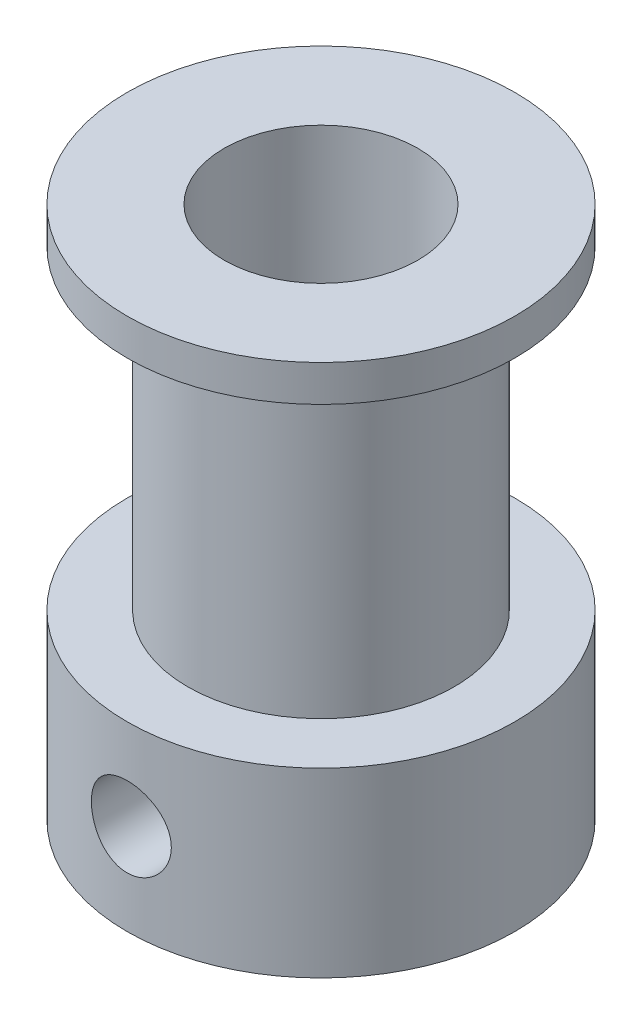
ISO-10303-21;
HEADER;
FILE_DESCRIPTION(('STEP AP214'),'2;1');
FILE_NAME('part.step','',(''),(''),'','','');
FILE_SCHEMA(('AUTOMOTIVE_DESIGN { 1 0 10303 214 1 1 1 1 }'));
ENDSEC;
DATA;
#1=APPLICATION_CONTEXT('core data for automotive mechanical design processes');
#2=APPLICATION_PROTOCOL_DEFINITION('international standard','automotive_design',2000,#1);
#3=PRODUCT_CONTEXT('',#1,'mechanical');
#4=PRODUCT('Part','Part','',(#3));
#5=PRODUCT_RELATED_PRODUCT_CATEGORY('part','',(#4));
#6=PRODUCT_DEFINITION_FORMATION('','',#4);
#7=PRODUCT_DEFINITION_CONTEXT('part definition',#1,'design');
#8=PRODUCT_DEFINITION('design','',#6,#7);
#9=PRODUCT_DEFINITION_SHAPE('','',#8);
#10=(LENGTH_UNIT() NAMED_UNIT(*) SI_UNIT(.MILLI.,.METRE.));
#11=(NAMED_UNIT(*) PLANE_ANGLE_UNIT() SI_UNIT($,.RADIAN.));
#12=(NAMED_UNIT(*) SI_UNIT($,.STERADIAN.) SOLID_ANGLE_UNIT());
#13=UNCERTAINTY_MEASURE_WITH_UNIT(LENGTH_MEASURE(1.E-05),#10,'distance_accuracy_value','');
#14=(GEOMETRIC_REPRESENTATION_CONTEXT(3) GLOBAL_UNCERTAINTY_ASSIGNED_CONTEXT((#13)) GLOBAL_UNIT_ASSIGNED_CONTEXT((#10,
#11,#12)) REPRESENTATION_CONTEXT('',''));
#15=CARTESIAN_POINT('',(0.,0.,0.));
#16=DIRECTION('',(0.,0.,1.));
#17=DIRECTION('',(1.,0.,0.));
#18=AXIS2_PLACEMENT_3D('',#15,#16,#17);
#19=CARTESIAN_POINT('',(0.,7.5,0.));
#20=DIRECTION('',(0.,1.,0.));
#21=DIRECTION('',(0.,0.,1.));
#22=AXIS2_PLACEMENT_3D('',#19,#20,#21);
#23=PLANE('',#22);
#24=CARTESIAN_POINT('',(0.,7.5,0.));
#25=DIRECTION('',(0.,1.,0.));
#26=DIRECTION('',(0.,0.,1.));
#27=AXIS2_PLACEMENT_3D('',#24,#25,#26);
#28=CIRCLE('',#27,8.);
#29=CARTESIAN_POINT('',(0.,7.5,8.));
#30=VERTEX_POINT('',#29);
#31=EDGE_CURVE('E10',#30,#30,#28,.T.);
#32=ORIENTED_EDGE('',*,*,#31,.T.);
#33=EDGE_LOOP('',(#32));
#34=FACE_BOUND('',#33,.T.);
#35=CARTESIAN_POINT('',(0.,7.5,0.));
#36=DIRECTION('',(0.,1.,0.));
#37=DIRECTION('',(0.,0.,1.));
#38=AXIS2_PLACEMENT_3D('',#35,#36,#37);
#39=CIRCLE('',#38,5.5);
#40=CARTESIAN_POINT('',(0.,7.5,5.5));
#41=VERTEX_POINT('',#40);
#42=EDGE_CURVE('E47',#41,#41,#39,.T.);
#43=ORIENTED_EDGE('',*,*,#42,.F.);
#44=EDGE_LOOP('',(#43));
#45=FACE_BOUND('',#44,.T.);
#46=ADVANCED_FACE('F34',(#34,#45),#23,.T.);
#47=CARTESIAN_POINT('',(0.,7.5,0.));
#48=DIRECTION('',(0.,-1.,0.));
#49=DIRECTION('',(0.,0.,-1.));
#50=AXIS2_PLACEMENT_3D('',#47,#48,#49);
#51=CYLINDRICAL_SURFACE('',#50,8.);
#52=CARTESIAN_POINT('',(-7.82799463464302,3.75,-1.65000000000002));
#53=CARTESIAN_POINT('',(-7.82799647234761,3.84161734979413,-1.64999668532495));
#54=CARTESIAN_POINT('',(-7.82962054015776,3.93327581475285,-1.64234339972767));
#55=CARTESIAN_POINT('',(-7.83593102109728,4.11399536908582,-1.61196056082938));
#56=CARTESIAN_POINT('',(-7.84061980768031,4.20305438944651,-1.5892193225455));
#57=CARTESIAN_POINT('',(-7.85250661788931,4.37593449220463,-1.52939944297716));
#58=CARTESIAN_POINT('',(-7.85970206178507,4.45976085561278,-1.49233553761894));
#59=CARTESIAN_POINT('',(-7.87578836285869,4.62000460226487,-1.40496339378159));
#60=CARTESIAN_POINT('',(-7.88467914491255,4.69642231357555,-1.35465574212319));
#61=CARTESIAN_POINT('',(-7.90330366333984,4.84083130314562,-1.24141806188278));
#62=CARTESIAN_POINT('',(-7.91304715328143,4.90869500128048,-1.17832691131061));
#63=CARTESIAN_POINT('',(-7.93219354684102,5.03295461376032,-1.04166118718971));
#64=CARTESIAN_POINT('',(-7.9415964257225,5.08934969657567,-0.968085854144728));
#65=CARTESIAN_POINT('',(-7.95910768239297,5.18956942635827,-0.811692001393481));
#66=CARTESIAN_POINT('',(-7.9672032148807,5.23327235381807,-0.728793920101091));
#67=CARTESIAN_POINT('',(-7.98107786735649,5.30608110943423,-0.556636173632906));
#68=CARTESIAN_POINT('',(-7.9868572180665,5.33518839158008,-0.467377143134544));
#69=CARTESIAN_POINT('',(-7.99537941797959,5.37758111250497,-0.286356118265347));
#70=CARTESIAN_POINT('',(-7.99816360714569,5.39108215209675,-0.194646593521417));
#71=CARTESIAN_POINT('',(-8.00052470522147,5.40255227142173,-0.0102247919218536));
#72=CARTESIAN_POINT('',(-8.00010194196704,5.40052293877214,0.0824873814688407));
#73=CARTESIAN_POINT('',(-7.9961286601365,5.3811524880959,0.264799667160857));
#74=CARTESIAN_POINT('',(-7.99262559257093,5.36404365512093,0.354425644609033));
#75=CARTESIAN_POINT('',(-7.98293899531616,5.3153688535758,0.529506535845897));
#76=CARTESIAN_POINT('',(-7.97675535366161,5.28380228111471,0.614961275239523));
#77=CARTESIAN_POINT('',(-7.96232481023259,5.20689604030914,0.779930808135305));
#78=CARTESIAN_POINT('',(-7.95406448397429,5.161466330109,0.859402403191171));
#79=CARTESIAN_POINT('',(-7.93638961806162,5.05819018594217,1.00967984091352));
#80=CARTESIAN_POINT('',(-7.9269749376687,5.00034223730045,1.08048462481767));
#81=CARTESIAN_POINT('',(-7.9078239642189,4.87260050730487,1.21279807501822));
#82=CARTESIAN_POINT('',(-7.89808494418977,4.80250342398988,1.27411022634261));
#83=CARTESIAN_POINT('',(-7.87954771497238,4.65292295474092,1.38414252261931));
#84=CARTESIAN_POINT('',(-7.87074952591437,4.57343936804768,1.43286239817595));
#85=CARTESIAN_POINT('',(-7.85508413098618,4.40704845467704,1.51640121308691));
#86=CARTESIAN_POINT('',(-7.84822159457677,4.32012382444695,1.55118662114804));
#87=CARTESIAN_POINT('',(-7.83727167258975,4.14148889177413,1.60559987539901));
#88=CARTESIAN_POINT('',(-7.83318390018328,4.04977925832742,1.625229834457));
#89=CARTESIAN_POINT('',(-7.82832430034405,3.86596343547278,1.64847767759944));
#90=CARTESIAN_POINT('',(-7.82749355348184,3.77389475085064,1.65238010858403));
#91=CARTESIAN_POINT('',(-7.82908365669821,3.59042212630601,1.64482933127382));
#92=CARTESIAN_POINT('',(-7.83150430988349,3.49901814646834,1.63337705280602));
#93=CARTESIAN_POINT('',(-7.83926913983493,3.32043707429369,1.59568777426683));
#94=CARTESIAN_POINT('',(-7.84458293687797,3.23322613369048,1.56960432546506));
#95=CARTESIAN_POINT('',(-7.85750843647708,3.06441223673719,1.50355797289369));
#96=CARTESIAN_POINT('',(-7.86512033846231,2.98280976784409,1.46359386451762));
#97=CARTESIAN_POINT('',(-7.88191579950282,2.82628854815773,1.37028211396983));
#98=CARTESIAN_POINT('',(-7.89111960565472,2.75147762450433,1.31675731908656));
#99=CARTESIAN_POINT('',(-7.91000699478186,2.61179547619869,1.1980782934733));
#100=CARTESIAN_POINT('',(-7.91969063034348,2.54692534419905,1.13292278604277));
#101=CARTESIAN_POINT('',(-7.93863877717958,2.42787906230575,0.991551131023601));
#102=CARTESIAN_POINT('',(-7.94789380519354,2.37389583014193,0.91517105125856));
#103=CARTESIAN_POINT('',(-7.96477402593325,2.27952771722255,0.754260738130239));
#104=CARTESIAN_POINT('',(-7.97239928979603,2.23914224289872,0.669730860728551));
#105=CARTESIAN_POINT('',(-7.98512048804082,2.17339319408157,0.495414150876506));
#106=CARTESIAN_POINT('',(-7.99023131933467,2.14794096923201,0.405661891513242));
#107=CARTESIAN_POINT('',(-7.99741186635557,2.11250124752192,0.223039444294558));
#108=CARTESIAN_POINT('',(-7.99948197278732,2.10251176383492,0.130169658580894));
#109=CARTESIAN_POINT('',(-8.00033781964049,2.09836207224363,-0.054212649205602));
#110=CARTESIAN_POINT('',(-7.99918360281958,2.10391248751722,-0.145718502140326));
#111=CARTESIAN_POINT('',(-7.99384751004402,2.13004339509045,-0.326463478938194));
#112=CARTESIAN_POINT('',(-7.98966567723011,2.15062367322843,-0.415702635080924));
#113=CARTESIAN_POINT('',(-7.97874682116245,2.2060981411582,-0.589186560182822));
#114=CARTESIAN_POINT('',(-7.97201637401338,2.24095551098701,-0.673443542985833));
#115=CARTESIAN_POINT('',(-7.95672300876336,2.32395704210639,-0.834953513276977));
#116=CARTESIAN_POINT('',(-7.9481599348062,2.37210233357252,-0.912205904261803));
#117=CARTESIAN_POINT('',(-7.92995681960444,2.48127864528561,-1.05893847166516));
#118=CARTESIAN_POINT('',(-7.92030089151861,2.54251556975004,-1.12826349061001));
#119=CARTESIAN_POINT('',(-7.90109178015231,2.67571624164646,-1.25575285452555));
#120=CARTESIAN_POINT('',(-7.89153862187156,2.74768253854538,-1.31391453937946));
#121=CARTESIAN_POINT('',(-7.87349423401939,2.9013011038279,-1.41807001635076));
#122=CARTESIAN_POINT('',(-7.86501660134748,2.98305600230841,-1.46391490783106));
#123=CARTESIAN_POINT('',(-7.85025069483304,3.15326288616914,-1.54114313624578));
#124=CARTESIAN_POINT('',(-7.84396047891661,3.2417088455668,-1.57253930936732));
#125=CARTESIAN_POINT('',(-7.83550744278865,3.40026722430231,-1.6140462079898));
#126=CARTESIAN_POINT('',(-7.83270799535492,3.46948894840103,-1.6275042042483));
#127=CARTESIAN_POINT('',(-7.82895092043293,3.60913237654465,-1.64548220150441));
#128=CARTESIAN_POINT('',(-7.82799322160417,3.67955403400329,-1.65000254870381));
#129=CARTESIAN_POINT('',(-7.82799463464302,3.75,-1.65000000000002));
#130=B_SPLINE_CURVE_WITH_KNOTS('',3,(#52,#53,#54,#55,#56,#57,#58,#59,#60,#61,#62,#63,#64,#65,
#66,#67,#68,#69,#70,#71,#72,#73,#74,#75,#76,#77,#78,#79,#80,#81,#82,#83,#84,#85,#86,#87,#88,#89,
#90,#91,#92,#93,#94,#95,#96,#97,#98,#99,#100,#101,#102,#103,#104,#105,#106,#107,#108,#109,#110,
#111,#112,#113,#114,#115,#116,#117,#118,#119,#120,#121,#122,#123,#124,#125,#126,#127,#128,#129),
.UNSPECIFIED.,.T.,.F.,(4,2,2,2,2,2,2,2,2,2,2,2,2,2,2,2,2,2,2,2,2,2,2,2,2,2,2,2,2,2,2,2,2,2,2,2,
2,2,4),(0.,0.274594036981749,0.549400984088786,0.823925944657621,1.09843874327276,
1.3766547467594,1.65489091505464,1.93571338943598,2.21650788327397,2.49337499570617,
2.77021380533169,3.04286128513493,3.31552015429503,3.58998907522695,3.86449149267072,
4.14407920367273,4.4236728956019,4.70393540521657,4.9841588355065,5.25928898855093,
5.53440248143716,5.80668132243981,6.07898379854718,6.35504561674318,6.6311377568341,
6.91175972338565,7.19236943866019,7.47129602001294,7.75018675877315,8.02391884651822,
8.29764703391013,8.57067368982019,8.84372357458458,9.1214337806041,9.39921008040027,
9.68020708192079,9.96095396255218,10.1721016499172,10.38324115827),.UNSPECIFIED.);
#131=CARTESIAN_POINT('',(-7.82799463464302,3.75,-1.65000000000002));
#132=VERTEX_POINT('',#131);
#133=EDGE_CURVE('E91',#132,#132,#130,.T.);
#134=ORIENTED_EDGE('',*,*,#133,.T.);
#135=EDGE_LOOP('',(#134));
#136=FACE_BOUND('',#135,.T.);
#137=CARTESIAN_POINT('',(-1.64999999999999,3.75,7.82799463464303));
#138=CARTESIAN_POINT('',(-1.64999668532493,3.84161734979413,7.82799647234762));
#139=CARTESIAN_POINT('',(-1.64234339972764,3.93327581475285,7.82962054015776));
#140=CARTESIAN_POINT('',(-1.61196056082935,4.11399536908582,7.83593102109728));
#141=CARTESIAN_POINT('',(-1.58921932254547,4.20305438944651,7.84061980768031));
#142=CARTESIAN_POINT('',(-1.52939944297714,4.37593449220463,7.85250661788931));
#143=CARTESIAN_POINT('',(-1.49233553761891,4.45976085561278,7.85970206178508));
#144=CARTESIAN_POINT('',(-1.40496339378156,4.62000460226487,7.8757883628587));
#145=CARTESIAN_POINT('',(-1.35465574212316,4.69642231357555,7.88467914491256));
#146=CARTESIAN_POINT('',(-1.24141806188275,4.84083130314562,7.90330366333985));
#147=CARTESIAN_POINT('',(-1.17832691131059,4.90869500128048,7.91304715328143));
#148=CARTESIAN_POINT('',(-1.04166118718968,5.03295461376032,7.93219354684102));
#149=CARTESIAN_POINT('',(-0.9680858541447,5.08934969657567,7.9415964257225));
#150=CARTESIAN_POINT('',(-0.811692001393454,5.18956942635827,7.95910768239297));
#151=CARTESIAN_POINT('',(-0.728793920101063,5.23327235381807,7.9672032148807));
#152=CARTESIAN_POINT('',(-0.556636173632879,5.30608110943423,7.98107786735649));
#153=CARTESIAN_POINT('',(-0.467377143134516,5.33518839158008,7.9868572180665));
#154=CARTESIAN_POINT('',(-0.28635611826532,5.37758111250497,7.99537941797959));
#155=CARTESIAN_POINT('',(-0.194646593521389,5.39108215209675,7.99816360714569));
#156=CARTESIAN_POINT('',(-0.010224791921826,5.40255227142173,8.00052470522147));
#157=CARTESIAN_POINT('',(0.0824873814688682,5.40052293877214,8.00010194196704));
#158=CARTESIAN_POINT('',(0.264799667160884,5.3811524880959,7.9961286601365));
#159=CARTESIAN_POINT('',(0.354425644609061,5.36404365512093,7.99262559257093));
#160=CARTESIAN_POINT('',(0.529506535845924,5.3153688535758,7.98293899531616));
#161=CARTESIAN_POINT('',(0.61496127523955,5.28380228111471,7.97675535366161));
#162=CARTESIAN_POINT('',(0.779930808135332,5.20689604030914,7.96232481023259));
#163=CARTESIAN_POINT('',(0.859402403191199,5.161466330109,7.95406448397429));
#164=CARTESIAN_POINT('',(1.00967984091354,5.05819018594217,7.93638961806161));
#165=CARTESIAN_POINT('',(1.08048462481769,5.00034223730045,7.92697493766869));
#166=CARTESIAN_POINT('',(1.21279807501824,4.87260050730487,7.9078239642189));
#167=CARTESIAN_POINT('',(1.27411022634264,4.80250342398989,7.89808494418976));
#168=CARTESIAN_POINT('',(1.38414252261934,4.65292295474092,7.87954771497238));
#169=CARTESIAN_POINT('',(1.43286239817597,4.57343936804768,7.87074952591437));
#170=CARTESIAN_POINT('',(1.51640121308694,4.40704845467704,7.85508413098618));
#171=CARTESIAN_POINT('',(1.55118662114807,4.32012382444695,7.84822159457677));
#172=CARTESIAN_POINT('',(1.60559987539903,4.14148889177413,7.83727167258975));
#173=CARTESIAN_POINT('',(1.62522983445702,4.04977925832743,7.83318390018328));
#174=CARTESIAN_POINT('',(1.64847767759947,3.86596343547278,7.82832430034404));
#175=CARTESIAN_POINT('',(1.65238010858406,3.77389475085064,7.82749355348184));
#176=CARTESIAN_POINT('',(1.64482933127385,3.59042212630601,7.8290836566982));
#177=CARTESIAN_POINT('',(1.63337705280605,3.49901814646834,7.83150430988348));
#178=CARTESIAN_POINT('',(1.59568777426686,3.32043707429369,7.83926913983493));
#179=CARTESIAN_POINT('',(1.56960432546508,3.23322613369048,7.84458293687796));
#180=CARTESIAN_POINT('',(1.50355797289372,3.06441223673719,7.85750843647708));
#181=CARTESIAN_POINT('',(1.46359386451765,2.98280976784409,7.8651203384623));
#182=CARTESIAN_POINT('',(1.37028211396986,2.82628854815773,7.88191579950281));
#183=CARTESIAN_POINT('',(1.31675731908659,2.75147762450433,7.89111960565472));
#184=CARTESIAN_POINT('',(1.19807829347332,2.61179547619869,7.91000699478186));
#185=CARTESIAN_POINT('',(1.1329227860428,2.54692534419906,7.91969063034348));
#186=CARTESIAN_POINT('',(0.99155113102363,2.42787906230575,7.93863877717957));
#187=CARTESIAN_POINT('',(0.915171051258588,2.37389583014193,7.94789380519354));
#188=CARTESIAN_POINT('',(0.754260738130267,2.27952771722255,7.96477402593325));
#189=CARTESIAN_POINT('',(0.66973086072858,2.23914224289872,7.97239928979603));
#190=CARTESIAN_POINT('',(0.495414150876535,2.17339319408157,7.98512048804082));
#191=CARTESIAN_POINT('',(0.405661891513271,2.14794096923201,7.99023131933467));
#192=CARTESIAN_POINT('',(0.223039444294587,2.11250124752192,7.99741186635557));
#193=CARTESIAN_POINT('',(0.130169658580922,2.10251176383492,7.99948197278732));
#194=CARTESIAN_POINT('',(-0.0542126492055734,2.09836207224363,8.00033781964049));
#195=CARTESIAN_POINT('',(-0.145718502140298,2.10391248751722,7.99918360281958));
#196=CARTESIAN_POINT('',(-0.326463478938166,2.13004339509045,7.99384751004402));
#197=CARTESIAN_POINT('',(-0.415702635080896,2.15062367322843,7.98966567723011));
#198=CARTESIAN_POINT('',(-0.589186560182793,2.2060981411582,7.97874682116246));
#199=CARTESIAN_POINT('',(-0.673443542985804,2.240955510987,7.97201637401338));
#200=CARTESIAN_POINT('',(-0.834953513276948,2.32395704210639,7.95672300876336));
#201=CARTESIAN_POINT('',(-0.912205904261775,2.37210233357252,7.9481599348062));
#202=CARTESIAN_POINT('',(-1.05893847166513,2.48127864528561,7.92995681960444));
#203=CARTESIAN_POINT('',(-1.12826349060999,2.54251556975004,7.92030089151861));
#204=CARTESIAN_POINT('',(-1.25575285452552,2.67571624164646,7.90109178015231));
#205=CARTESIAN_POINT('',(-1.31391453937944,2.74768253854538,7.89153862187157));
#206=CARTESIAN_POINT('',(-1.41807001635073,2.90130110382791,7.8734942340194));
#207=CARTESIAN_POINT('',(-1.46391490783103,2.98305600230841,7.86501660134749));
#208=CARTESIAN_POINT('',(-1.54114313624576,3.15326288616914,7.85025069483304));
#209=CARTESIAN_POINT('',(-1.57253930936729,3.2417088455668,7.84396047891661));
#210=CARTESIAN_POINT('',(-1.61404620798977,3.40026722430231,7.83550744278865));
#211=CARTESIAN_POINT('',(-1.62750420424827,3.46948894840103,7.83270799535493));
#212=CARTESIAN_POINT('',(-1.64548220150438,3.60913237654465,7.82895092043294));
#213=CARTESIAN_POINT('',(-1.65000254870379,3.67955403400329,7.82799322160417));
#214=CARTESIAN_POINT('',(-1.64999999999999,3.75,7.82799463464303));
#215=B_SPLINE_CURVE_WITH_KNOTS('',3,(#137,#138,#139,#140,#141,#142,#143,#144,#145,#146,#147,
#148,#149,#150,#151,#152,#153,#154,#155,#156,#157,#158,#159,#160,#161,#162,#163,#164,#165,#166,
#167,#168,#169,#170,#171,#172,#173,#174,#175,#176,#177,#178,#179,#180,#181,#182,#183,#184,#185,
#186,#187,#188,#189,#190,#191,#192,#193,#194,#195,#196,#197,#198,#199,#200,#201,#202,#203,#204,
#205,#206,#207,#208,#209,#210,#211,#212,#213,#214),.UNSPECIFIED.,.T.,.F.,(4,2,2,2,2,2,2,2,2,2,2,
2,2,2,2,2,2,2,2,2,2,2,2,2,2,2,2,2,2,2,2,2,2,2,2,2,2,2,4),(0.,0.274594036981749,
0.549400984088785,0.82392594465762,1.09843874327276,1.3766547467594,1.65489091505464,
1.93571338943597,2.21650788327397,2.49337499570617,2.77021380533169,3.04286128513493,
3.31552015429503,3.58998907522695,3.86449149267071,4.14407920367273,4.42367289560189,
4.70393540521657,4.9841588355065,5.25928898855093,5.53440248143716,5.8066813224398,
6.07898379854718,6.35504561674318,6.6311377568341,6.91175972338564,7.19236943866019,
7.47129602001293,7.75018675877315,8.02391884651822,8.29764703391013,8.57067368982019,
8.84372357458458,9.1214337806041,9.39921008040027,9.68020708192079,9.96095396255218,
10.1721016499172,10.38324115827),.UNSPECIFIED.);
#216=CARTESIAN_POINT('',(-1.64999999999999,3.75,7.82799463464303));
#217=VERTEX_POINT('',#216);
#218=EDGE_CURVE('E71',#217,#217,#215,.T.);
#219=ORIENTED_EDGE('',*,*,#218,.T.);
#220=EDGE_LOOP('',(#219));
#221=FACE_BOUND('',#220,.T.);
#222=ORIENTED_EDGE('',*,*,#31,.F.);
#223=EDGE_LOOP('',(#222));
#224=FACE_BOUND('',#223,.T.);
#225=CARTESIAN_POINT('',(0.,0.,0.));
#226=DIRECTION('',(0.,1.,0.));
#227=DIRECTION('',(0.,0.,1.));
#228=AXIS2_PLACEMENT_3D('',#225,#226,#227);
#229=CIRCLE('',#228,8.);
#230=CARTESIAN_POINT('',(0.,0.,8.));
#231=VERTEX_POINT('',#230);
#232=EDGE_CURVE('E38',#231,#231,#229,.T.);
#233=ORIENTED_EDGE('',*,*,#232,.T.);
#234=EDGE_LOOP('',(#233));
#235=FACE_BOUND('',#234,.T.);
#236=ADVANCED_FACE('F36',(#136,#221,#224,#235),#51,.T.);
#237=CARTESIAN_POINT('',(0.,0.,0.));
#238=DIRECTION('',(0.,1.,0.));
#239=DIRECTION('',(0.,0.,1.));
#240=AXIS2_PLACEMENT_3D('',#237,#238,#239);
#241=PLANE('',#240);
#242=CARTESIAN_POINT('',(0.,0.,0.));
#243=DIRECTION('',(0.,1.,0.));
#244=DIRECTION('',(0.,0.,1.));
#245=AXIS2_PLACEMENT_3D('',#242,#243,#244);
#246=CIRCLE('',#245,4.);
#247=CARTESIAN_POINT('',(0.,0.,4.));
#248=VERTEX_POINT('',#247);
#249=EDGE_CURVE('E56',#248,#248,#246,.T.);
#250=ORIENTED_EDGE('',*,*,#249,.T.);
#251=EDGE_LOOP('',(#250));
#252=FACE_BOUND('',#251,.T.);
#253=ORIENTED_EDGE('',*,*,#232,.F.);
#254=EDGE_LOOP('',(#253));
#255=FACE_BOUND('',#254,.T.);
#256=ADVANCED_FACE('F134',(#252,#255),#241,.F.);
#257=CARTESIAN_POINT('',(0.,20.5,0.));
#258=DIRECTION('',(0.,-1.,0.));
#259=DIRECTION('',(0.,0.,-1.));
#260=AXIS2_PLACEMENT_3D('',#257,#258,#259);
#261=CYLINDRICAL_SURFACE('',#260,5.5);
#262=CARTESIAN_POINT('',(0.,20.5,0.));
#263=DIRECTION('',(0.,1.,0.));
#264=DIRECTION('',(0.,0.,1.));
#265=AXIS2_PLACEMENT_3D('',#262,#263,#264);
#266=CIRCLE('',#265,5.5);
#267=CARTESIAN_POINT('',(0.,20.5,5.5));
#268=VERTEX_POINT('',#267);
#269=EDGE_CURVE('E45',#268,#268,#266,.T.);
#270=ORIENTED_EDGE('',*,*,#269,.F.);
#271=EDGE_LOOP('',(#270));
#272=FACE_BOUND('',#271,.T.);
#273=ORIENTED_EDGE('',*,*,#42,.T.);
#274=EDGE_LOOP('',(#273));
#275=FACE_BOUND('',#274,.T.);
#276=ADVANCED_FACE('F128',(#272,#275),#261,.T.);
#277=CARTESIAN_POINT('',(0.,20.5,0.));
#278=DIRECTION('',(0.,1.,0.));
#279=DIRECTION('',(0.,0.,1.));
#280=AXIS2_PLACEMENT_3D('',#277,#278,#279);
#281=PLANE('',#280);
#282=CARTESIAN_POINT('',(0.,20.5,0.));
#283=DIRECTION('',(0.,1.,0.));
#284=DIRECTION('',(0.,0.,1.));
#285=AXIS2_PLACEMENT_3D('',#282,#283,#284);
#286=CIRCLE('',#285,8.);
#287=CARTESIAN_POINT('',(0.,20.5,8.));
#288=VERTEX_POINT('',#287);
#289=EDGE_CURVE('E53',#288,#288,#286,.T.);
#290=ORIENTED_EDGE('',*,*,#289,.F.);
#291=EDGE_LOOP('',(#290));
#292=FACE_BOUND('',#291,.T.);
#293=ORIENTED_EDGE('',*,*,#269,.T.);
#294=EDGE_LOOP('',(#293));
#295=FACE_BOUND('',#294,.T.);
#296=ADVANCED_FACE('F122',(#292,#295),#281,.F.);
#297=CARTESIAN_POINT('',(0.,22.,0.));
#298=DIRECTION('',(0.,-1.,0.));
#299=DIRECTION('',(0.,0.,-1.));
#300=AXIS2_PLACEMENT_3D('',#297,#298,#299);
#301=CYLINDRICAL_SURFACE('',#300,8.);
#302=CARTESIAN_POINT('',(0.,22.,0.));
#303=DIRECTION('',(0.,1.,0.));
#304=DIRECTION('',(0.,0.,1.));
#305=AXIS2_PLACEMENT_3D('',#302,#303,#304);
#306=CIRCLE('',#305,8.);
#307=CARTESIAN_POINT('',(0.,22.,8.));
#308=VERTEX_POINT('',#307);
#309=EDGE_CURVE('E50',#308,#308,#306,.T.);
#310=ORIENTED_EDGE('',*,*,#309,.F.);
#311=EDGE_LOOP('',(#310));
#312=FACE_BOUND('',#311,.T.);
#313=ORIENTED_EDGE('',*,*,#289,.T.);
#314=EDGE_LOOP('',(#313));
#315=FACE_BOUND('',#314,.T.);
#316=ADVANCED_FACE('F117',(#312,#315),#301,.T.);
#317=CARTESIAN_POINT('',(0.,22.,0.));
#318=DIRECTION('',(0.,1.,0.));
#319=DIRECTION('',(0.,0.,1.));
#320=AXIS2_PLACEMENT_3D('',#317,#318,#319);
#321=PLANE('',#320);
#322=CARTESIAN_POINT('',(0.,22.,0.));
#323=DIRECTION('',(0.,1.,0.));
#324=DIRECTION('',(0.,0.,1.));
#325=AXIS2_PLACEMENT_3D('',#322,#323,#324);
#326=CIRCLE('',#325,4.);
#327=CARTESIAN_POINT('',(0.,22.,4.));
#328=VERTEX_POINT('',#327);
#329=EDGE_CURVE('E59',#328,#328,#326,.T.);
#330=ORIENTED_EDGE('',*,*,#329,.F.);
#331=EDGE_LOOP('',(#330));
#332=FACE_BOUND('',#331,.T.);
#333=ORIENTED_EDGE('',*,*,#309,.T.);
#334=EDGE_LOOP('',(#333));
#335=FACE_BOUND('',#334,.T.);
#336=ADVANCED_FACE('F110',(#332,#335),#321,.T.);
#337=CARTESIAN_POINT('',(0.,0.,0.));
#338=DIRECTION('',(0.,1.,0.));
#339=DIRECTION('',(0.,0.,1.));
#340=AXIS2_PLACEMENT_3D('',#337,#338,#339);
#341=CYLINDRICAL_SURFACE('',#340,4.);
#342=CARTESIAN_POINT('',(-3.64383040220041,3.75,-1.65000000000001));
#343=CARTESIAN_POINT('',(-3.64383945275152,3.66190351977432,-1.64999056813103));
#344=CARTESIAN_POINT('',(-3.64707173267573,3.57365956802641,-1.64289989177359));
#345=CARTESIAN_POINT('',(-3.65959209124688,3.39971293892112,-1.61480845546374));
#346=CARTESIAN_POINT('',(-3.66889676295874,3.3140178994024,-1.5937695789634));
#347=CARTESIAN_POINT('',(-3.69231325052125,3.14799706186937,-1.53873536249639));
#348=CARTESIAN_POINT('',(-3.70640571161012,3.06765117978141,-1.50479212400174));
#349=CARTESIAN_POINT('',(-3.73778230052357,2.91381823316578,-1.42506535594207));
#350=CARTESIAN_POINT('',(-3.75506562873472,2.84032945721597,-1.37928479159596));
#351=CARTESIAN_POINT('',(-3.7920553041855,2.6977713121535,-1.27419856290372));
#352=CARTESIAN_POINT('',(-3.81184277704779,2.6291707442198,-1.21428518241361));
#353=CARTESIAN_POINT('',(-3.85094363418238,2.50264522809125,-1.08391072165484));
#354=CARTESIAN_POINT('',(-3.87025683535296,2.44472434852778,-1.01344563996365));
#355=CARTESIAN_POINT('',(-3.90721575035942,2.33882862869814,-0.860301943593392));
#356=CARTESIAN_POINT('',(-3.92475616703247,2.29137906729385,-0.777232390113601));
#357=CARTESIAN_POINT('',(-3.95520283117798,2.2113298546783,-0.603436361875868));
#358=CARTESIAN_POINT('',(-3.96811109652272,2.17872373565345,-0.512713242513056));
#359=CARTESIAN_POINT('',(-3.98726403378776,2.13097929334378,-0.33110517230441));
#360=CARTESIAN_POINT('',(-3.99381564337609,2.11503315207677,-0.240465625184504));
#361=CARTESIAN_POINT('',(-4.0006306156112,2.09845334814483,-0.0575763551498781));
#362=CARTESIAN_POINT('',(-4.00089647540932,2.097813604678,0.0346727137709419));
#363=CARTESIAN_POINT('',(-3.99529224160632,2.1114364961366,0.212297380895971));
#364=CARTESIAN_POINT('',(-3.98978733384659,2.1248121837171,0.297754665400383));
#365=CARTESIAN_POINT('',(-3.97375926025945,2.16456881744776,0.465085845235265));
#366=CARTESIAN_POINT('',(-3.96323572489497,2.19095072129069,0.546959476205478));
#367=CARTESIAN_POINT('',(-3.93798907731603,2.25628766172019,0.706295606817214));
#368=CARTESIAN_POINT('',(-3.92320447216363,2.29542798992488,0.783671979762454));
#369=CARTESIAN_POINT('',(-3.89088763760773,2.38499127918661,0.930960489992451));
#370=CARTESIAN_POINT('',(-3.87335444442337,2.43541820050331,1.0008699945393));
#371=CARTESIAN_POINT('',(-3.83587133640028,2.55018823902864,1.13638530947039));
#372=CARTESIAN_POINT('',(-3.8158381454309,2.61525341089873,1.20135746318643));
#373=CARTESIAN_POINT('',(-3.77653142784556,2.75540966632158,1.31973838423492));
#374=CARTESIAN_POINT('',(-3.75725818494774,2.83050444926331,1.373142865722));
#375=CARTESIAN_POINT('',(-3.7210660715691,2.99159840354732,1.46845339844826));
#376=CARTESIAN_POINT('',(-3.70424107982559,3.07786757169265,1.50994179309275));
#377=CARTESIAN_POINT('',(-3.67596385006486,3.2570466714059,1.57754508127094));
#378=CARTESIAN_POINT('',(-3.66450786071418,3.34995191387382,1.60367071206119));
#379=CARTESIAN_POINT('',(-3.64919091711419,3.53342289518499,1.6382132035594));
#380=CARTESIAN_POINT('',(-3.64489111171832,3.62375830118286,1.6476556945468));
#381=CARTESIAN_POINT('',(-3.64311980380968,3.8048056296986,1.65157101672825));
#382=CARTESIAN_POINT('',(-3.6456460160745,3.89551741605928,1.646048857804));
#383=CARTESIAN_POINT('',(-3.65678944366162,4.06880100904947,1.62112710501825));
#384=CARTESIAN_POINT('',(-3.66501803861665,4.15152817967461,1.60261202118541));
#385=CARTESIAN_POINT('',(-3.68614612916708,4.31263706437997,1.55339580262013));
#386=CARTESIAN_POINT('',(-3.69904670212357,4.39101777135166,1.52269185697121));
#387=CARTESIAN_POINT('',(-3.72872477858183,4.54487900569563,1.44853902204983));
#388=CARTESIAN_POINT('',(-3.74564214050946,4.62010019477924,1.40460979308262));
#389=CARTESIAN_POINT('',(-3.78124523189865,4.76246016942973,1.30573455409449));
#390=CARTESIAN_POINT('',(-3.79993171387675,4.82959548773512,1.25078384473682));
#391=CARTESIAN_POINT('',(-3.83876011670653,4.95942962644671,1.12627542162097));
#392=CARTESIAN_POINT('',(-3.85889967217623,5.02135173704872,1.05590387126702));
#393=CARTESIAN_POINT('',(-3.89698114804695,5.13264285566206,0.905297980080087));
#394=CARTESIAN_POINT('',(-3.91492292631237,5.18201105200319,0.825063002026887));
#395=CARTESIAN_POINT('',(-3.94668767391886,5.26670413420678,0.656516816883251));
#396=CARTESIAN_POINT('',(-3.96050313975064,5.30200347500272,0.568191273870476));
#397=CARTESIAN_POINT('',(-3.98237104121022,5.35699165685874,0.386140833605162));
#398=CARTESIAN_POINT('',(-3.9904268305481,5.37668958293893,0.292419112817546));
#399=CARTESIAN_POINT('',(-3.9994889299446,5.39878822892048,0.109187189544822));
#400=CARTESIAN_POINT('',(-4.00094173424749,5.40228482874193,0.0198303081186213));
#401=CARTESIAN_POINT('',(-3.99786220239438,5.39481456562971,-0.158161739195425));
#402=CARTESIAN_POINT('',(-3.99333087896147,5.38385015000454,-0.246797024648493));
#403=CARTESIAN_POINT('',(-3.979024148364,5.34855535786443,-0.417705375935888));
#404=CARTESIAN_POINT('',(-3.96943363922013,5.32469555788544,-0.500092371627863));
#405=CARTESIAN_POINT('',(-3.94605480923815,5.26479588512,-0.65966735573417));
#406=CARTESIAN_POINT('',(-3.93226568297162,5.22875367521331,-0.736854343148754));
#407=CARTESIAN_POINT('',(-3.90105808483759,5.14369547331361,-0.887661133732629));
#408=CARTESIAN_POINT('',(-3.88350423911689,5.09416874322707,-0.96096421436116));
#409=CARTESIAN_POINT('',(-3.84685709666619,4.98429715321,-1.09852932170706));
#410=CARTESIAN_POINT('',(-3.82776324400832,4.92394837691919,-1.16278806031651));
#411=CARTESIAN_POINT('',(-3.78859741195737,4.78941247264534,-1.28487769945048));
#412=CARTESIAN_POINT('',(-3.76854475207571,4.71457224311506,-1.34199767947158));
#413=CARTESIAN_POINT('',(-3.73105419200533,4.55573402431893,-1.44296474677331));
#414=CARTESIAN_POINT('',(-3.71361773967119,4.47173100829041,-1.48680449811904));
#415=CARTESIAN_POINT('',(-3.68370387904713,4.2972715587301,-1.55944447766652));
#416=CARTESIAN_POINT('',(-3.67119480418033,4.2068608919089,-1.58834112875234));
#417=CARTESIAN_POINT('',(-3.65281837075146,4.02195285592164,-1.63017263567573));
#418=CARTESIAN_POINT('',(-3.64692873900432,3.92747030912313,-1.64316103312975));
#419=CARTESIAN_POINT('',(-3.64414054419779,3.80513668635736,-1.6493120932942));
#420=CARTESIAN_POINT('',(-3.64382756923722,3.77757556771498,-1.65000295232161));
#421=CARTESIAN_POINT('',(-3.64383040220041,3.75,-1.65000000000001));
#422=B_SPLINE_CURVE_WITH_KNOTS('',3,(#342,#343,#344,#345,#346,#347,#348,#349,#350,#351,#352,
#353,#354,#355,#356,#357,#358,#359,#360,#361,#362,#363,#364,#365,#366,#367,#368,#369,#370,#371,
#372,#373,#374,#375,#376,#377,#378,#379,#380,#381,#382,#383,#384,#385,#386,#387,#388,#389,#390,
#391,#392,#393,#394,#395,#396,#397,#398,#399,#400,#401,#402,#403,#404,#405,#406,#407,#408,#409,
#410,#411,#412,#413,#414,#415,#416,#417,#418,#419,#420,#421),.UNSPECIFIED.,.T.,.F.,(4,2,2,2,2,2,
2,2,2,2,2,2,2,2,2,2,2,2,2,2,2,2,2,2,2,2,2,2,2,2,2,2,2,2,2,2,2,2,2,4),(0.,0.264211724660743,
0.529148459018595,0.793026677872046,1.05683885985755,1.33523297260791,1.61373292676209,
1.90403076094907,2.19420198072698,2.46953816244269,2.74476495901023,3.00356896819765,
3.2623920368679,3.52515526924738,3.78801084539544,4.06907613148063,4.35024537535723,
4.64031806272421,4.93018777241108,5.20152035698261,5.4727621157604,5.72713321026164,
5.98156300028878,6.24665916965706,6.51186861189121,6.79815687284344,7.0844636389886,
7.37128791456167,7.65794504349147,7.92489841526076,8.19180661499932,8.44957452423756,
8.70739191275385,8.97680852354691,9.24632283025303,9.53374725602172,9.82133016535512,
10.1070334851925,10.3917725616093,10.4744749384331),.UNSPECIFIED.);
#423=CARTESIAN_POINT('',(-3.64383040220041,3.75,-1.65000000000001));
#424=VERTEX_POINT('',#423);
#425=EDGE_CURVE('E95',#424,#424,#422,.T.);
#426=ORIENTED_EDGE('',*,*,#425,.T.);
#427=EDGE_LOOP('',(#426));
#428=FACE_BOUND('',#427,.T.);
#429=CARTESIAN_POINT('',(0.,2.10000000000001,4.));
#430=CARTESIAN_POINT('',(0.0884596783632785,2.10000921720664,3.99999309817074));
#431=CARTESIAN_POINT('',(0.177062252057582,2.10715601434332,3.99703145792172));
#432=CARTESIAN_POINT('',(0.351759669836408,2.1354911419369,3.9854711320255));
#433=CARTESIAN_POINT('',(0.437847271996959,2.15671651102432,3.97685757767606));
#434=CARTESIAN_POINT('',(0.604702496902739,2.2122948122019,3.95491965529936));
#435=CARTESIAN_POINT('',(0.685486934491194,2.24660364335346,3.94161112398211));
#436=CARTESIAN_POINT('',(0.840076633223485,2.32719475784943,3.91158286286531));
#437=CARTESIAN_POINT('',(0.913884076117563,2.37347328117016,3.89486420463244));
#438=CARTESIAN_POINT('',(1.05618769598525,2.47910675464405,3.85876900012149));
#439=CARTESIAN_POINT('',(1.12429373957476,2.53895767024898,3.83930654387258));
#440=CARTESIAN_POINT('',(1.24983574384757,2.66898883965898,3.80029483347099));
#441=CARTESIAN_POINT('',(1.30726618926957,2.73917439921181,3.78074553976622));
#442=CARTESIAN_POINT('',(1.41254826809049,2.89196824887172,3.74272551686067));
#443=CARTESIAN_POINT('',(1.45980781790561,2.97501111530653,3.72435159658093));
#444=CARTESIAN_POINT('',(1.53951358199406,3.14873630929018,3.69212136090386));
#445=CARTESIAN_POINT('',(1.5719672771279,3.23941475136301,3.67826276509115));
#446=CARTESIAN_POINT('',(1.61953738222492,3.42134799700183,3.65756021871623));
#447=CARTESIAN_POINT('',(1.63540371417153,3.51237107214307,3.65041449103236));
#448=CARTESIAN_POINT('',(1.65168918120802,3.69604650736528,3.64307714795703));
#449=CARTESIAN_POINT('',(1.65211659474,3.7886979676293,3.64288180572738));
#450=CARTESIAN_POINT('',(1.6380778077983,3.96559888661872,3.64921138579605));
#451=CARTESIAN_POINT('',(1.62472398487458,4.04995815874916,3.6552343974104));
#452=CARTESIAN_POINT('',(1.58536484231197,4.21511028438117,3.67247532251837));
#453=CARTESIAN_POINT('',(1.55935715587184,4.2959024676033,3.68369420783859));
#454=CARTESIAN_POINT('',(1.49492412942488,4.45364510875862,3.71031458481431));
#455=CARTESIAN_POINT('',(1.45624866973016,4.53047873780833,3.72579923184191));
#456=CARTESIAN_POINT('',(1.36775445443624,4.67686023246003,3.75918616236907));
#457=CARTESIAN_POINT('',(1.31793135478159,4.74640524224915,3.77708938726885));
#458=CARTESIAN_POINT('',(1.20371911924869,4.88228640778781,3.81509742396095));
#459=CARTESIAN_POINT('',(1.13846630094388,4.94788195770325,3.8352618825369));
#460=CARTESIAN_POINT('',(0.997682554866211,5.06744467444137,3.87426910607353));
#461=CARTESIAN_POINT('',(0.92214931984743,5.12140922386084,3.8931115728953));
#462=CARTESIAN_POINT('',(0.760736369737321,5.21723477358503,3.92787932271737));
#463=CARTESIAN_POINT('',(0.674664094072233,5.25880028319417,3.94373050716791));
#464=CARTESIAN_POINT('',(0.495928253552974,5.32660302410887,3.97016319816605));
#465=CARTESIAN_POINT('',(0.403268287372383,5.35284855321116,3.98074755693754));
#466=CARTESIAN_POINT('',(0.220181304317672,5.38772950367822,3.99492450637935));
#467=CARTESIAN_POINT('',(0.12997417230822,5.39735917793593,3.99891121146315));
#468=CARTESIAN_POINT('',(-0.050847440152223,5.40169204376329,4.00069746426785));
#469=CARTESIAN_POINT('',(-0.141461799500567,5.39639941310821,3.99849874371343));
#470=CARTESIAN_POINT('',(-0.315907755487548,5.37175473175704,3.98841747083847));
#471=CARTESIAN_POINT('',(-0.399855317526685,5.3530959266599,3.9808153168881));
#472=CARTESIAN_POINT('',(-0.563340473329574,5.30320790366289,3.96098887803091));
#473=CARTESIAN_POINT('',(-0.642877505872145,5.2719770901852,3.94876400644332));
#474=CARTESIAN_POINT('',(-0.798061975964473,5.1968106200191,3.92039728883464));
#475=CARTESIAN_POINT('',(-0.873512656660505,5.15251143824378,3.90414585630856));
#476=CARTESIAN_POINT('',(-1.01617847320907,5.05286606574213,3.86946768187548));
#477=CARTESIAN_POINT('',(-1.0833901834211,4.99751530491016,3.85104004134398));
#478=CARTESIAN_POINT('',(-1.21261994292741,4.87279569518802,3.8124029584454));
#479=CARTESIAN_POINT('',(-1.27394364561822,4.8027161759607,3.79215916493832));
#480=CARTESIAN_POINT('',(-1.38414835482505,4.65292870939147,3.75333928940831));
#481=CARTESIAN_POINT('',(-1.43302674162727,4.57321874005744,3.73476355904109));
#482=CARTESIAN_POINT('',(-1.51742282291387,4.40490462946668,3.70128700339843));
#483=CARTESIAN_POINT('',(-1.55275802936534,4.31619808399194,3.68643724424496));
#484=CARTESIAN_POINT('',(-1.60769618165393,4.13329083402175,3.66281640168181));
#485=CARTESIAN_POINT('',(-1.62731175174752,4.03909460358182,3.65404044124936));
#486=CARTESIAN_POINT('',(-1.64901123940267,3.85556972684193,3.64429559365239));
#487=CARTESIAN_POINT('',(-1.65231049364124,3.76641278054206,3.64278573581524));
#488=CARTESIAN_POINT('',(-1.64451485356567,3.58887152924082,3.64631178238904));
#489=CARTESIAN_POINT('',(-1.63342206561729,3.50048711308063,3.65134672892697));
#490=CARTESIAN_POINT('',(-1.59817118006571,3.3310669287423,3.666904904187));
#491=CARTESIAN_POINT('',(-1.57461958437453,3.24987928857789,3.67717261200251));
#492=CARTESIAN_POINT('',(-1.51570599472927,3.09258547752592,3.70184411206584));
#493=CARTESIAN_POINT('',(-1.48034069596892,3.01648073570239,3.71624906152171));
#494=CARTESIAN_POINT('',(-1.3963806225379,2.86657796175861,3.7486340889516));
#495=CARTESIAN_POINT('',(-1.3471244359927,2.79318592897859,3.76677577854003));
#496=CARTESIAN_POINT('',(-1.23771718137822,2.65532831273572,3.80412864636709));
#497=CARTESIAN_POINT('',(-1.17756245772962,2.59086573722558,3.82334018195057));
#498=CARTESIAN_POINT('',(-1.04300738755743,2.46800586129633,3.86230172013188));
#499=CARTESIAN_POINT('',(-0.967900110730173,2.41036077639448,3.88199359359226));
#500=CARTESIAN_POINT('',(-0.808343463182031,2.30845984046129,3.91832426905579));
#501=CARTESIAN_POINT('',(-0.723889843442848,2.26421011363411,3.9349616732268));
#502=CARTESIAN_POINT('',(-0.549414760109625,2.19133626016526,3.96305691394126));
#503=CARTESIAN_POINT('',(-0.459513381649423,2.16245757464146,3.97459855421812));
#504=CARTESIAN_POINT('',(-0.27571922921324,2.12048891521486,3.99154438775475));
#505=CARTESIAN_POINT('',(-0.181839966818028,2.10734933375456,3.99696786149576));
#506=CARTESIAN_POINT('',(-0.0584442952271953,2.10077322966997,3.99968194626838));
#507=CARTESIAN_POINT('',(-0.0292299486703375,2.09999695433579,4.00000228058838));
#508=CARTESIAN_POINT('',(0.,2.10000000000001,4.));
#509=B_SPLINE_CURVE_WITH_KNOTS('',3,(#429,#430,#431,#432,#433,#434,#435,#436,#437,#438,#439,
#440,#441,#442,#443,#444,#445,#446,#447,#448,#449,#450,#451,#452,#453,#454,#455,#456,#457,#458,
#459,#460,#461,#462,#463,#464,#465,#466,#467,#468,#469,#470,#471,#472,#473,#474,#475,#476,#477,
#478,#479,#480,#481,#482,#483,#484,#485,#486,#487,#488,#489,#490,#491,#492,#493,#494,#495,#496,
#497,#498,#499,#500,#501,#502,#503,#504,#505,#506,#507,#508),.UNSPECIFIED.,.T.,.F.,(4,2,2,2,2,2,
2,2,2,2,2,2,2,2,2,2,2,2,2,2,2,2,2,2,2,2,2,2,2,2,2,2,2,2,2,2,2,2,2,4),(0.,0.265297098770619,
0.531294937906658,0.796403981498878,1.06142984766523,1.33841878994456,1.61555043582129,
1.90598404924537,2.19627075414924,2.4727764853942,2.74913395037959,3.00480633611682,
3.2605265616686,3.5216353930134,3.78284615202014,4.06565185095455,4.34852112528508,
4.63767392136374,4.92666995726766,5.19768149557684,5.46861716672804,5.72643264660553,
5.98428085748383,6.25011488704504,6.51605907418431,6.800645802504,7.08529238632157,
7.37364985225779,7.66177550895674,7.92807823226722,8.19434198489782,8.44869772098557,
8.70312467109942,8.97267479984707,9.2423155088521,9.53104085816539,9.81989801073176,
10.1038095613048,10.3868238858898,10.4744866574817),.UNSPECIFIED.);
#510=CARTESIAN_POINT('',(0.,2.10000000000001,4.));
#511=VERTEX_POINT('',#510);
#512=EDGE_CURVE('E62',#511,#511,#509,.T.);
#513=ORIENTED_EDGE('',*,*,#512,.T.);
#514=EDGE_LOOP('',(#513));
#515=FACE_BOUND('',#514,.T.);
#516=ORIENTED_EDGE('',*,*,#249,.F.);
#517=EDGE_LOOP('',(#516));
#518=FACE_BOUND('',#517,.T.);
#519=ORIENTED_EDGE('',*,*,#329,.T.);
#520=EDGE_LOOP('',(#519));
#521=FACE_BOUND('',#520,.T.);
#522=ADVANCED_FACE('F76',(#428,#515,#518,#521),#341,.F.);
#523=CARTESIAN_POINT('',(0.,3.75,0.));
#524=DIRECTION('',(0.,0.,-1.));
#525=DIRECTION('',(-1.,0.,0.));
#526=AXIS2_PLACEMENT_3D('',#523,#524,#525);
#527=CYLINDRICAL_SURFACE('',#526,1.64999999999999);
#528=ORIENTED_EDGE('',*,*,#218,.F.);
#529=EDGE_LOOP('',(#528));
#530=FACE_BOUND('',#529,.T.);
#531=ORIENTED_EDGE('',*,*,#512,.F.);
#532=EDGE_LOOP('',(#531));
#533=FACE_BOUND('',#532,.T.);
#534=ADVANCED_FACE('F79',(#530,#533),#527,.F.);
#535=CARTESIAN_POINT('',(0.,3.75,0.));
#536=DIRECTION('',(1.,0.,0.));
#537=DIRECTION('',(0.,0.,-1.));
#538=AXIS2_PLACEMENT_3D('',#535,#536,#537);
#539=CYLINDRICAL_SURFACE('',#538,1.64999999999999);
#540=ORIENTED_EDGE('',*,*,#133,.F.);
#541=EDGE_LOOP('',(#540));
#542=FACE_BOUND('',#541,.T.);
#543=ORIENTED_EDGE('',*,*,#425,.F.);
#544=EDGE_LOOP('',(#543));
#545=FACE_BOUND('',#544,.T.);
#546=ADVANCED_FACE('F83',(#542,#545),#539,.F.);
#547=CLOSED_SHELL('',(#46,#236,#256,#276,#296,#316,#336,#522,#534,#546));
#548=MANIFOLD_SOLID_BREP('B2',#547);
#549=ADVANCED_BREP_SHAPE_REPRESENTATION('',(#18,#548),#14);
#550=SHAPE_DEFINITION_REPRESENTATION(#9,#549);
ENDSEC;
END-ISO-10303-21;
